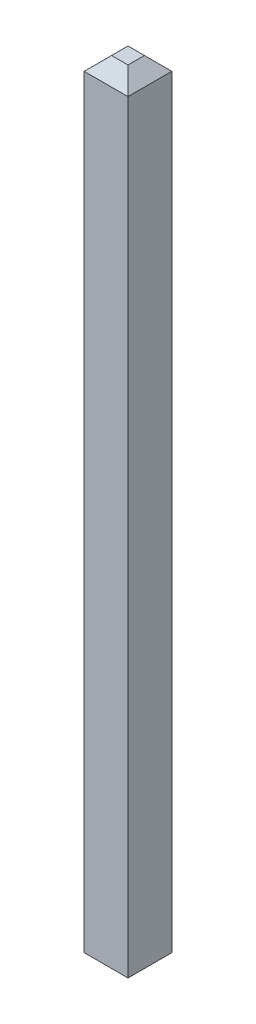
ISO-10303-21;
HEADER;
FILE_DESCRIPTION(('STEP AP214'),'2;1');
FILE_NAME('part.step','',(''),(''),'','','');
FILE_SCHEMA(('AUTOMOTIVE_DESIGN { 1 0 10303 214 1 1 1 1 }'));
ENDSEC;
DATA;
#1=APPLICATION_CONTEXT('core data for automotive mechanical design processes');
#2=APPLICATION_PROTOCOL_DEFINITION('international standard','automotive_design',2000,#1);
#3=PRODUCT_CONTEXT('',#1,'mechanical');
#4=PRODUCT('Part','Part','',(#3));
#5=PRODUCT_RELATED_PRODUCT_CATEGORY('part','',(#4));
#6=PRODUCT_DEFINITION_FORMATION('','',#4);
#7=PRODUCT_DEFINITION_CONTEXT('part definition',#1,'design');
#8=PRODUCT_DEFINITION('design','',#6,#7);
#9=PRODUCT_DEFINITION_SHAPE('','',#8);
#10=(LENGTH_UNIT() NAMED_UNIT(*) SI_UNIT(.MILLI.,.METRE.));
#11=(NAMED_UNIT(*) PLANE_ANGLE_UNIT() SI_UNIT($,.RADIAN.));
#12=(NAMED_UNIT(*) SI_UNIT($,.STERADIAN.) SOLID_ANGLE_UNIT());
#13=UNCERTAINTY_MEASURE_WITH_UNIT(LENGTH_MEASURE(1.E-05),#10,'distance_accuracy_value','');
#14=(GEOMETRIC_REPRESENTATION_CONTEXT(3) GLOBAL_UNCERTAINTY_ASSIGNED_CONTEXT((#13)) GLOBAL_UNIT_ASSIGNED_CONTEXT((#10,
#11,#12)) REPRESENTATION_CONTEXT('',''));
#15=CARTESIAN_POINT('',(0.,0.,0.));
#16=DIRECTION('',(0.,0.,1.));
#17=DIRECTION('',(1.,0.,0.));
#18=AXIS2_PLACEMENT_3D('',#15,#16,#17);
#19=CARTESIAN_POINT('',(-6.03,7.07,-0.32));
#20=DIRECTION('',(-0.707106781186548,-0.707106781186548,0.));
#21=DIRECTION('',(-0.707106781186548,0.707106781186548,0.));
#22=AXIS2_PLACEMENT_3D('',#19,#20,#21);
#23=PLANE('',#22);
#24=DIRECTION('',(0.577350269189626,-0.577350269189626,0.577350269189626));
#25=VECTOR('',#24,1.);
#26=CARTESIAN_POINT('',(-6.243333333333,7.283333333333,0.106666666667));
#27=LINE('',#26,#25);
#28=CARTESIAN_POINT('',(-6.23,7.27,0.12));
#29=VERTEX_POINT('',#28);
#30=CARTESIAN_POINT('',(-6.03,7.07,0.32));
#31=VERTEX_POINT('',#30);
#32=EDGE_CURVE('E170',#29,#31,#27,.T.);
#33=ORIENTED_EDGE('',*,*,#32,.T.);
#34=DIRECTION('',(0.,0.,1.));
#35=VECTOR('',#34,1.);
#36=CARTESIAN_POINT('',(-6.03,7.07,-0.32));
#37=LINE('',#36,#35);
#38=CARTESIAN_POINT('',(-6.03,7.07,-0.32));
#39=VERTEX_POINT('',#38);
#40=EDGE_CURVE('E110',#39,#31,#37,.T.);
#41=ORIENTED_EDGE('',*,*,#40,.F.);
#42=DIRECTION('',(0.577350269189626,-0.577350269189626,-0.577350269189626));
#43=VECTOR('',#42,1.);
#44=CARTESIAN_POINT('',(-6.03,7.07,-0.32));
#45=LINE('',#44,#43);
#46=CARTESIAN_POINT('',(-6.23,7.27,-0.12));
#47=VERTEX_POINT('',#46);
#48=EDGE_CURVE('E11',#47,#39,#45,.T.);
#49=ORIENTED_EDGE('',*,*,#48,.F.);
#50=DIRECTION('',(0.,0.,-1.));
#51=VECTOR('',#50,1.);
#52=CARTESIAN_POINT('',(-6.23,7.27,-0.32));
#53=LINE('',#52,#51);
#54=EDGE_CURVE('E157',#29,#47,#53,.T.);
#55=ORIENTED_EDGE('',*,*,#54,.F.);
#56=EDGE_LOOP('',(#33,#41,#49,#55));
#57=FACE_BOUND('',#56,.T.);
#58=ADVANCED_FACE('F17',(#57),#23,.F.);
#59=CARTESIAN_POINT('',(-6.35,7.07,-0.32));
#60=DIRECTION('',(0.,0.707106781186548,-0.707106781186548));
#61=DIRECTION('',(-1.,0.,0.));
#62=AXIS2_PLACEMENT_3D('',#59,#60,#61);
#63=PLANE('',#62);
#64=DIRECTION('',(0.577350269189626,0.577350269189626,0.577350269189626));
#65=VECTOR('',#64,1.);
#66=CARTESIAN_POINT('',(-6.536666666667,7.203333333333,-0.186666666667));
#67=LINE('',#66,#65);
#68=CARTESIAN_POINT('',(-6.67,7.07,-0.32));
#69=VERTEX_POINT('',#68);
#70=CARTESIAN_POINT('',(-6.47,7.27,-0.12));
#71=VERTEX_POINT('',#70);
#72=EDGE_CURVE('E25',#69,#71,#67,.T.);
#73=ORIENTED_EDGE('',*,*,#72,.T.);
#74=DIRECTION('',(-1.,0.,0.));
#75=VECTOR('',#74,1.);
#76=CARTESIAN_POINT('',(-6.67,7.27,-0.12));
#77=LINE('',#76,#75);
#78=EDGE_CURVE('E161',#47,#71,#77,.T.);
#79=ORIENTED_EDGE('',*,*,#78,.F.);
#80=ORIENTED_EDGE('',*,*,#48,.T.);
#81=DIRECTION('',(1.,0.,0.));
#82=VECTOR('',#81,1.);
#83=CARTESIAN_POINT('',(-6.03,7.07,-0.32));
#84=LINE('',#83,#82);
#85=EDGE_CURVE('E232',#69,#39,#84,.T.);
#86=ORIENTED_EDGE('',*,*,#85,.F.);
#87=EDGE_LOOP('',(#73,#79,#80,#86));
#88=FACE_BOUND('',#87,.T.);
#89=ADVANCED_FACE('F310',(#88),#63,.T.);
#90=CARTESIAN_POINT('',(-6.47,7.27,-0.32));
#91=DIRECTION('',(0.707106781186548,-0.707106781186548,0.));
#92=DIRECTION('',(0.,0.,-1.));
#93=AXIS2_PLACEMENT_3D('',#90,#91,#92);
#94=PLANE('',#93);
#95=DIRECTION('',(-0.577350269189626,-0.577350269189626,0.577350269189626));
#96=VECTOR('',#95,1.);
#97=CARTESIAN_POINT('',(-6.536666666667,7.203333333333,0.186666666667));
#98=LINE('',#97,#96);
#99=CARTESIAN_POINT('',(-6.47,7.27,0.12));
#100=VERTEX_POINT('',#99);
#101=CARTESIAN_POINT('',(-6.67,7.07,0.32));
#102=VERTEX_POINT('',#101);
#103=EDGE_CURVE('E37',#100,#102,#98,.T.);
#104=ORIENTED_EDGE('',*,*,#103,.F.);
#105=DIRECTION('',(0.,0.,1.));
#106=VECTOR('',#105,1.);
#107=CARTESIAN_POINT('',(-6.47,7.27,-0.32));
#108=LINE('',#107,#106);
#109=EDGE_CURVE('E165',#71,#100,#108,.T.);
#110=ORIENTED_EDGE('',*,*,#109,.F.);
#111=ORIENTED_EDGE('',*,*,#72,.F.);
#112=DIRECTION('',(0.,0.,-1.));
#113=VECTOR('',#112,1.);
#114=CARTESIAN_POINT('',(-6.67,7.07,-0.32));
#115=LINE('',#114,#113);
#116=EDGE_CURVE('E250',#102,#69,#115,.T.);
#117=ORIENTED_EDGE('',*,*,#116,.F.);
#118=EDGE_LOOP('',(#104,#110,#111,#117));
#119=FACE_BOUND('',#118,.T.);
#120=ADVANCED_FACE('F317',(#119),#94,.F.);
#121=CARTESIAN_POINT('',(-6.67,7.27,0.12));
#122=DIRECTION('',(0.,-0.707106781186548,-0.707106781186548));
#123=DIRECTION('',(0.,-0.707106781186548,0.707106781186548));
#124=AXIS2_PLACEMENT_3D('',#121,#122,#123);
#125=PLANE('',#124);
#126=ORIENTED_EDGE('',*,*,#32,.F.);
#127=DIRECTION('',(1.,0.,0.));
#128=VECTOR('',#127,1.);
#129=CARTESIAN_POINT('',(-6.67,7.27,0.12));
#130=LINE('',#129,#128);
#131=EDGE_CURVE('E166',#100,#29,#130,.T.);
#132=ORIENTED_EDGE('',*,*,#131,.F.);
#133=ORIENTED_EDGE('',*,*,#103,.T.);
#134=DIRECTION('',(-1.,0.,0.));
#135=VECTOR('',#134,1.);
#136=CARTESIAN_POINT('',(-6.35,7.07,0.32));
#137=LINE('',#136,#135);
#138=EDGE_CURVE('E116',#31,#102,#137,.T.);
#139=ORIENTED_EDGE('',*,*,#138,.F.);
#140=EDGE_LOOP('',(#126,#132,#133,#139));
#141=FACE_BOUND('',#140,.T.);
#142=ADVANCED_FACE('F314',(#141),#125,.F.);
#143=CARTESIAN_POINT('',(-6.67,7.27,-0.32));
#144=DIRECTION('',(0.,-1.,0.));
#145=DIRECTION('',(0.,0.,-1.));
#146=AXIS2_PLACEMENT_3D('',#143,#144,#145);
#147=PLANE('',#146);
#148=ORIENTED_EDGE('',*,*,#54,.T.);
#149=ORIENTED_EDGE('',*,*,#78,.T.);
#150=ORIENTED_EDGE('',*,*,#109,.T.);
#151=ORIENTED_EDGE('',*,*,#131,.T.);
#152=EDGE_LOOP('',(#148,#149,#150,#151));
#153=FACE_BOUND('',#152,.T.);
#154=ADVANCED_FACE('F316',(#153),#147,.F.);
#155=CARTESIAN_POINT('',(-6.03,7.27,-0.32));
#156=DIRECTION('',(-1.,0.,0.));
#157=DIRECTION('',(0.,1.,0.));
#158=AXIS2_PLACEMENT_3D('',#155,#156,#157);
#159=PLANE('',#158);
#160=DIRECTION('',(0.,-1.,0.));
#161=VECTOR('',#160,1.);
#162=CARTESIAN_POINT('',(-6.03,7.27,-0.32));
#163=LINE('',#162,#161);
#164=CARTESIAN_POINT('',(-6.03,-4.07,-0.32));
#165=VERTEX_POINT('',#164);
#166=EDGE_CURVE('E228',#39,#165,#163,.T.);
#167=ORIENTED_EDGE('',*,*,#166,.F.);
#168=ORIENTED_EDGE('',*,*,#40,.T.);
#169=DIRECTION('',(0.,-1.,0.));
#170=VECTOR('',#169,1.);
#171=CARTESIAN_POINT('',(-6.03,7.27,0.32));
#172=LINE('',#171,#170);
#173=CARTESIAN_POINT('',(-6.03,-4.07,0.32));
#174=VERTEX_POINT('',#173);
#175=EDGE_CURVE('E103',#31,#174,#172,.T.);
#176=ORIENTED_EDGE('',*,*,#175,.T.);
#177=DIRECTION('',(0.,0.,-1.));
#178=VECTOR('',#177,1.);
#179=CARTESIAN_POINT('',(-6.03,-4.07,-0.32));
#180=LINE('',#179,#178);
#181=EDGE_CURVE('E107',#174,#165,#180,.T.);
#182=ORIENTED_EDGE('',*,*,#181,.T.);
#183=EDGE_LOOP('',(#167,#168,#176,#182));
#184=FACE_BOUND('',#183,.T.);
#185=ADVANCED_FACE('F106',(#184),#159,.F.);
#186=CARTESIAN_POINT('',(-6.35,1.5,0.32));
#187=DIRECTION('',(0.,0.,-1.));
#188=DIRECTION('',(0.,-1.,0.));
#189=AXIS2_PLACEMENT_3D('',#186,#187,#188);
#190=PLANE('',#189);
#191=ORIENTED_EDGE('',*,*,#175,.F.);
#192=ORIENTED_EDGE('',*,*,#138,.T.);
#193=DIRECTION('',(0.,1.,0.));
#194=VECTOR('',#193,1.);
#195=CARTESIAN_POINT('',(-6.67,-4.27,0.32));
#196=LINE('',#195,#194);
#197=CARTESIAN_POINT('',(-6.67,-4.07,0.32));
#198=VERTEX_POINT('',#197);
#199=EDGE_CURVE('E133',#198,#102,#196,.T.);
#200=ORIENTED_EDGE('',*,*,#199,.F.);
#201=DIRECTION('',(1.,0.,0.));
#202=VECTOR('',#201,1.);
#203=CARTESIAN_POINT('',(-6.35,-4.07,0.32));
#204=LINE('',#203,#202);
#205=EDGE_CURVE('E128',#198,#174,#204,.T.);
#206=ORIENTED_EDGE('',*,*,#205,.T.);
#207=EDGE_LOOP('',(#191,#192,#200,#206));
#208=FACE_BOUND('',#207,.T.);
#209=ADVANCED_FACE('F131',(#208),#190,.F.);
#210=CARTESIAN_POINT('',(-6.23,-4.27,-0.32));
#211=DIRECTION('',(-0.707106781186548,0.707106781186548,0.));
#212=DIRECTION('',(0.,0.,1.));
#213=AXIS2_PLACEMENT_3D('',#210,#211,#212);
#214=PLANE('',#213);
#215=DIRECTION('',(-0.577350269189626,-0.577350269189626,0.577350269189626));
#216=VECTOR('',#215,1.);
#217=CARTESIAN_POINT('',(-6.163333333333,-4.203333333333,-0.186666666667));
#218=LINE('',#217,#216);
#219=CARTESIAN_POINT('',(-6.23,-4.27,-0.12));
#220=VERTEX_POINT('',#219);
#221=EDGE_CURVE('E125',#165,#220,#218,.T.);
#222=ORIENTED_EDGE('',*,*,#221,.F.);
#223=ORIENTED_EDGE('',*,*,#181,.F.);
#224=DIRECTION('',(-0.577350269189626,-0.577350269189626,-0.577350269189626));
#225=VECTOR('',#224,1.);
#226=CARTESIAN_POINT('',(-6.376666666667,-4.416666666667,-0.02666666666667));
#227=LINE('',#226,#225);
#228=CARTESIAN_POINT('',(-6.23,-4.27,0.12));
#229=VERTEX_POINT('',#228);
#230=EDGE_CURVE('E123',#174,#229,#227,.T.);
#231=ORIENTED_EDGE('',*,*,#230,.T.);
#232=DIRECTION('',(0.,0.,1.));
#233=VECTOR('',#232,1.);
#234=CARTESIAN_POINT('',(-6.23,-4.27,-0.32));
#235=LINE('',#234,#233);
#236=EDGE_CURVE('E287',#220,#229,#235,.T.);
#237=ORIENTED_EDGE('',*,*,#236,.F.);
#238=EDGE_LOOP('',(#222,#223,#231,#237));
#239=FACE_BOUND('',#238,.T.);
#240=ADVANCED_FACE('F120',(#239),#214,.F.);
#241=CARTESIAN_POINT('',(-6.03,-4.27,0.12));
#242=DIRECTION('',(0.,0.707106781186548,-0.707106781186548));
#243=DIRECTION('',(-1.,0.,0.));
#244=AXIS2_PLACEMENT_3D('',#241,#242,#243);
#245=PLANE('',#244);
#246=ORIENTED_EDGE('',*,*,#230,.F.);
#247=ORIENTED_EDGE('',*,*,#205,.F.);
#248=DIRECTION('',(-0.577350269189626,0.577350269189626,0.577350269189626));
#249=VECTOR('',#248,1.);
#250=CARTESIAN_POINT('',(-6.456666666667,-4.283333333333,0.106666666667));
#251=LINE('',#250,#249);
#252=CARTESIAN_POINT('',(-6.47,-4.27,0.12));
#253=VERTEX_POINT('',#252);
#254=EDGE_CURVE('E143',#253,#198,#251,.T.);
#255=ORIENTED_EDGE('',*,*,#254,.F.);
#256=DIRECTION('',(-1.,0.,0.));
#257=VECTOR('',#256,1.);
#258=CARTESIAN_POINT('',(-6.03,-4.27,0.12));
#259=LINE('',#258,#257);
#260=EDGE_CURVE('E140',#229,#253,#259,.T.);
#261=ORIENTED_EDGE('',*,*,#260,.F.);
#262=EDGE_LOOP('',(#246,#247,#255,#261));
#263=FACE_BOUND('',#262,.T.);
#264=ADVANCED_FACE('F138',(#263),#245,.F.);
#265=CARTESIAN_POINT('',(-6.67,-4.07,-0.32));
#266=DIRECTION('',(0.707106781186548,0.707106781186548,0.));
#267=DIRECTION('',(0.,0.,-1.));
#268=AXIS2_PLACEMENT_3D('',#265,#266,#267);
#269=PLANE('',#268);
#270=DIRECTION('',(0.577350269189626,-0.577350269189626,0.577350269189626));
#271=VECTOR('',#270,1.);
#272=CARTESIAN_POINT('',(-6.563333333333,-4.176666666667,-0.213333333333));
#273=LINE('',#272,#271);
#274=CARTESIAN_POINT('',(-6.67,-4.07,-0.32));
#275=VERTEX_POINT('',#274);
#276=CARTESIAN_POINT('',(-6.47,-4.27,-0.12));
#277=VERTEX_POINT('',#276);
#278=EDGE_CURVE('E260',#275,#277,#273,.T.);
#279=ORIENTED_EDGE('',*,*,#278,.T.);
#280=DIRECTION('',(0.,0.,-1.));
#281=VECTOR('',#280,1.);
#282=CARTESIAN_POINT('',(-6.47,-4.27,-0.32));
#283=LINE('',#282,#281);
#284=EDGE_CURVE('E277',#253,#277,#283,.T.);
#285=ORIENTED_EDGE('',*,*,#284,.F.);
#286=ORIENTED_EDGE('',*,*,#254,.T.);
#287=DIRECTION('',(0.,0.,1.));
#288=VECTOR('',#287,1.);
#289=CARTESIAN_POINT('',(-6.67,-4.07,-0.32));
#290=LINE('',#289,#288);
#291=EDGE_CURVE('E149',#275,#198,#290,.T.);
#292=ORIENTED_EDGE('',*,*,#291,.F.);
#293=EDGE_LOOP('',(#279,#285,#286,#292));
#294=FACE_BOUND('',#293,.T.);
#295=ADVANCED_FACE('F398',(#294),#269,.F.);
#296=CARTESIAN_POINT('',(-6.67,-4.27,-0.32));
#297=DIRECTION('',(1.,0.,0.));
#298=DIRECTION('',(0.,0.,1.));
#299=AXIS2_PLACEMENT_3D('',#296,#297,#298);
#300=PLANE('',#299);
#301=ORIENTED_EDGE('',*,*,#199,.T.);
#302=ORIENTED_EDGE('',*,*,#116,.T.);
#303=DIRECTION('',(0.,1.,0.));
#304=VECTOR('',#303,1.);
#305=CARTESIAN_POINT('',(-6.67,-4.27,-0.32));
#306=LINE('',#305,#304);
#307=EDGE_CURVE('E239',#275,#69,#306,.T.);
#308=ORIENTED_EDGE('',*,*,#307,.F.);
#309=ORIENTED_EDGE('',*,*,#291,.T.);
#310=EDGE_LOOP('',(#301,#302,#308,#309));
#311=FACE_BOUND('',#310,.T.);
#312=ADVANCED_FACE('F309',(#311),#300,.F.);
#313=CARTESIAN_POINT('',(-6.35,1.5,-0.32));
#314=DIRECTION('',(0.,0.,-1.));
#315=DIRECTION('',(0.,-1.,0.));
#316=AXIS2_PLACEMENT_3D('',#313,#314,#315);
#317=PLANE('',#316);
#318=ORIENTED_EDGE('',*,*,#307,.T.);
#319=ORIENTED_EDGE('',*,*,#85,.T.);
#320=ORIENTED_EDGE('',*,*,#166,.T.);
#321=DIRECTION('',(-1.,0.,0.));
#322=VECTOR('',#321,1.);
#323=CARTESIAN_POINT('',(-6.67,-4.07,-0.32));
#324=LINE('',#323,#322);
#325=EDGE_CURVE('E246',#165,#275,#324,.T.);
#326=ORIENTED_EDGE('',*,*,#325,.T.);
#327=EDGE_LOOP('',(#318,#319,#320,#326));
#328=FACE_BOUND('',#327,.T.);
#329=ADVANCED_FACE('F306',(#328),#317,.T.);
#330=CARTESIAN_POINT('',(-6.35,-4.07,-0.32));
#331=DIRECTION('',(0.,-0.707106781186548,-0.707106781186548));
#332=DIRECTION('',(0.,-0.707106781186548,0.707106781186548));
#333=AXIS2_PLACEMENT_3D('',#330,#331,#332);
#334=PLANE('',#333);
#335=ORIENTED_EDGE('',*,*,#278,.F.);
#336=ORIENTED_EDGE('',*,*,#325,.F.);
#337=ORIENTED_EDGE('',*,*,#221,.T.);
#338=DIRECTION('',(1.,0.,0.));
#339=VECTOR('',#338,1.);
#340=CARTESIAN_POINT('',(-6.03,-4.27,-0.12));
#341=LINE('',#340,#339);
#342=EDGE_CURVE('E270',#277,#220,#341,.T.);
#343=ORIENTED_EDGE('',*,*,#342,.F.);
#344=EDGE_LOOP('',(#335,#336,#337,#343));
#345=FACE_BOUND('',#344,.T.);
#346=ADVANCED_FACE('F427',(#345),#334,.T.);
#347=CARTESIAN_POINT('',(-6.03,-4.27,-0.32));
#348=DIRECTION('',(0.,1.,0.));
#349=DIRECTION('',(0.,0.,-1.));
#350=AXIS2_PLACEMENT_3D('',#347,#348,#349);
#351=PLANE('',#350);
#352=ORIENTED_EDGE('',*,*,#236,.T.);
#353=ORIENTED_EDGE('',*,*,#260,.T.);
#354=ORIENTED_EDGE('',*,*,#284,.T.);
#355=ORIENTED_EDGE('',*,*,#342,.T.);
#356=EDGE_LOOP('',(#352,#353,#354,#355));
#357=FACE_BOUND('',#356,.T.);
#358=ADVANCED_FACE('F437',(#357),#351,.F.);
#359=CLOSED_SHELL('',(#58,#89,#120,#142,#154,#185,#209,#240,#264,#295,#312,#329,#346,#358));
#360=MANIFOLD_SOLID_BREP('B1',#359);
#361=ADVANCED_BREP_SHAPE_REPRESENTATION('',(#18,#360),#14);
#362=SHAPE_DEFINITION_REPRESENTATION(#9,#361);
ENDSEC;
END-ISO-10303-21;
